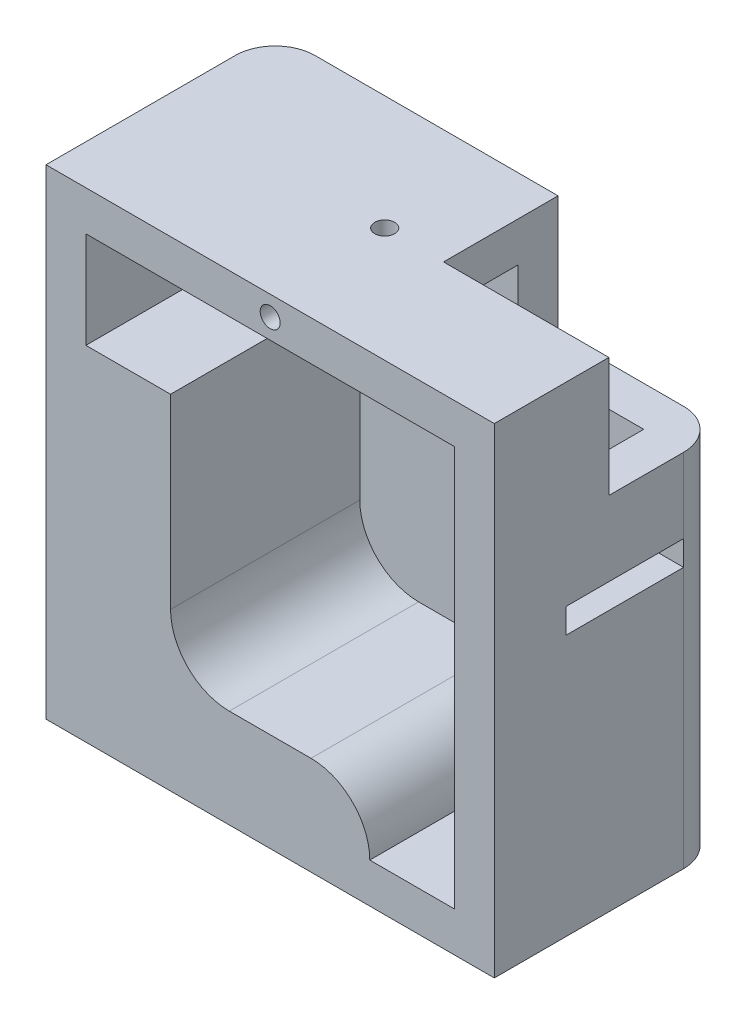
ISO-10303-21;
HEADER;
FILE_DESCRIPTION(('STEP AP214'),'2;1');
FILE_NAME('part.step','',(''),(''),'','','');
FILE_SCHEMA(('AUTOMOTIVE_DESIGN { 1 0 10303 214 1 1 1 1 }'));
ENDSEC;
DATA;
#1=APPLICATION_CONTEXT('core data for automotive mechanical design processes');
#2=APPLICATION_PROTOCOL_DEFINITION('international standard','automotive_design',2000,#1);
#3=PRODUCT_CONTEXT('',#1,'mechanical');
#4=PRODUCT('Part','Part','',(#3));
#5=PRODUCT_RELATED_PRODUCT_CATEGORY('part','',(#4));
#6=PRODUCT_DEFINITION_FORMATION('','',#4);
#7=PRODUCT_DEFINITION_CONTEXT('part definition',#1,'design');
#8=PRODUCT_DEFINITION('design','',#6,#7);
#9=PRODUCT_DEFINITION_SHAPE('','',#8);
#10=(LENGTH_UNIT() NAMED_UNIT(*) SI_UNIT(.MILLI.,.METRE.));
#11=(NAMED_UNIT(*) PLANE_ANGLE_UNIT() SI_UNIT($,.RADIAN.));
#12=(NAMED_UNIT(*) SI_UNIT($,.STERADIAN.) SOLID_ANGLE_UNIT());
#13=UNCERTAINTY_MEASURE_WITH_UNIT(LENGTH_MEASURE(1.E-05),#10,'distance_accuracy_value','');
#14=(GEOMETRIC_REPRESENTATION_CONTEXT(3) GLOBAL_UNCERTAINTY_ASSIGNED_CONTEXT((#13)) GLOBAL_UNIT_ASSIGNED_CONTEXT((#10,
#11,#12)) REPRESENTATION_CONTEXT('',''));
#15=CARTESIAN_POINT('',(0.,0.,0.));
#16=DIRECTION('',(0.,0.,1.));
#17=DIRECTION('',(1.,0.,0.));
#18=AXIS2_PLACEMENT_3D('',#15,#16,#17);
#19=CARTESIAN_POINT('',(22.5,24.1,-7.5));
#20=DIRECTION('',(0.,0.,1.));
#21=DIRECTION('',(1.,0.,0.));
#22=AXIS2_PLACEMENT_3D('',#19,#20,#21);
#23=PLANE('',#22);
#24=DIRECTION('',(0.,1.,0.));
#25=VECTOR('',#24,1.);
#26=CARTESIAN_POINT('',(-18.5,-20.1,-7.5));
#27=LINE('',#26,#25);
#28=CARTESIAN_POINT('',(-18.5,2.1,-7.5));
#29=VERTEX_POINT('',#28);
#30=CARTESIAN_POINT('',(-18.5,4.6,-7.5));
#31=VERTEX_POINT('',#30);
#32=EDGE_CURVE('E287',#29,#31,#27,.T.);
#33=ORIENTED_EDGE('',*,*,#32,.T.);
#34=DIRECTION('',(1.,0.,0.));
#35=VECTOR('',#34,1.);
#36=CARTESIAN_POINT('',(-22.5,4.6,-7.5));
#37=LINE('',#36,#35);
#38=CARTESIAN_POINT('',(-22.5,4.6,-7.5));
#39=VERTEX_POINT('',#38);
#40=EDGE_CURVE('E512',#39,#31,#37,.T.);
#41=ORIENTED_EDGE('',*,*,#40,.F.);
#42=DIRECTION('',(0.,1.,0.));
#43=VECTOR('',#42,1.);
#44=CARTESIAN_POINT('',(-22.5,4.6,-7.5));
#45=LINE('',#44,#43);
#46=CARTESIAN_POINT('',(-22.5,2.1,-7.5));
#47=VERTEX_POINT('',#46);
#48=EDGE_CURVE('E499',#47,#39,#45,.T.);
#49=ORIENTED_EDGE('',*,*,#48,.F.);
#50=DIRECTION('',(1.,0.,0.));
#51=VECTOR('',#50,1.);
#52=CARTESIAN_POINT('',(-22.5,2.1,-7.5));
#53=LINE('',#52,#51);
#54=EDGE_CURVE('E517',#47,#29,#53,.T.);
#55=ORIENTED_EDGE('',*,*,#54,.T.);
#56=EDGE_LOOP('',(#33,#41,#49,#55));
#57=FACE_BOUND('',#56,.T.);
#58=ADVANCED_FACE('F47',(#57),#23,.T.);
#59=CARTESIAN_POINT('',(22.5,24.1,-11.5));
#60=DIRECTION('',(0.,0.,1.));
#61=DIRECTION('',(1.,0.,0.));
#62=AXIS2_PLACEMENT_3D('',#59,#60,#61);
#63=PLANE('',#62);
#64=DIRECTION('',(-1.,0.,0.));
#65=VECTOR('',#64,1.);
#66=CARTESIAN_POINT('',(22.5,24.1,-11.5));
#67=LINE('',#66,#65);
#68=CARTESIAN_POINT('',(5.9,24.1,-11.5));
#69=VERTEX_POINT('',#68);
#70=CARTESIAN_POINT('',(-18.5,24.1,-11.5));
#71=VERTEX_POINT('',#70);
#72=EDGE_CURVE('E381',#69,#71,#67,.T.);
#73=ORIENTED_EDGE('',*,*,#72,.F.);
#74=DIRECTION('',(0.,-1.,0.));
#75=VECTOR('',#74,1.);
#76=CARTESIAN_POINT('',(5.9,18.4,-11.5));
#77=LINE('',#76,#75);
#78=CARTESIAN_POINT('',(5.9,12.1,-11.5));
#79=VERTEX_POINT('',#78);
#80=EDGE_CURVE('E541',#69,#79,#77,.T.);
#81=ORIENTED_EDGE('',*,*,#80,.T.);
#82=DIRECTION('',(-1.,0.,0.));
#83=VECTOR('',#82,1.);
#84=CARTESIAN_POINT('',(18.5,12.1,-11.5));
#85=LINE('',#84,#83);
#86=CARTESIAN_POINT('',(18.5,12.1,-11.5));
#87=VERTEX_POINT('',#86);
#88=EDGE_CURVE('E618',#87,#79,#85,.T.);
#89=ORIENTED_EDGE('',*,*,#88,.F.);
#90=DIRECTION('',(0.,1.,0.));
#91=VECTOR('',#90,1.);
#92=CARTESIAN_POINT('',(18.5,24.1,-11.5));
#93=LINE('',#92,#91);
#94=CARTESIAN_POINT('',(18.5,-24.1,-11.5));
#95=VERTEX_POINT('',#94);
#96=EDGE_CURVE('E400',#87,#95,#93,.F.);
#97=ORIENTED_EDGE('',*,*,#96,.T.);
#98=DIRECTION('',(-1.,0.,0.));
#99=VECTOR('',#98,1.);
#100=CARTESIAN_POINT('',(22.5,-24.1,-11.5));
#101=LINE('',#100,#99);
#102=CARTESIAN_POINT('',(-18.5,-24.1,-11.5));
#103=VERTEX_POINT('',#102);
#104=EDGE_CURVE('E361',#95,#103,#101,.T.);
#105=ORIENTED_EDGE('',*,*,#104,.T.);
#106=DIRECTION('',(0.,1.,0.));
#107=VECTOR('',#106,1.);
#108=CARTESIAN_POINT('',(-18.5,14.9,-11.5));
#109=LINE('',#108,#107);
#110=CARTESIAN_POINT('',(-18.5,14.9,-11.5));
#111=VERTEX_POINT('',#110);
#112=EDGE_CURVE('E396',#103,#111,#109,.T.);
#113=ORIENTED_EDGE('',*,*,#112,.T.);
#114=DIRECTION('',(-1.,0.,0.));
#115=VECTOR('',#114,1.);
#116=CARTESIAN_POINT('',(-22.5,14.9,-11.5));
#117=LINE('',#116,#115);
#118=CARTESIAN_POINT('',(-5.9,14.9,-11.5));
#119=VERTEX_POINT('',#118);
#120=EDGE_CURVE('E545',#119,#111,#117,.T.);
#121=ORIENTED_EDGE('',*,*,#120,.F.);
#122=DIRECTION('',(0.,-1.,0.));
#123=VECTOR('',#122,1.);
#124=CARTESIAN_POINT('',(-5.9,18.4,-11.5));
#125=LINE('',#124,#123);
#126=CARTESIAN_POINT('',(-5.9,18.4,-11.5));
#127=VERTEX_POINT('',#126);
#128=EDGE_CURVE('E439',#127,#119,#125,.T.);
#129=ORIENTED_EDGE('',*,*,#128,.F.);
#130=DIRECTION('',(-1.,0.,0.));
#131=VECTOR('',#130,1.);
#132=CARTESIAN_POINT('',(-22.5,18.4,-11.5));
#133=LINE('',#132,#131);
#134=CARTESIAN_POINT('',(-18.5,18.4,-11.5));
#135=VERTEX_POINT('',#134);
#136=EDGE_CURVE('E427',#127,#135,#133,.T.);
#137=ORIENTED_EDGE('',*,*,#136,.T.);
#138=DIRECTION('',(0.,1.,0.));
#139=VECTOR('',#138,1.);
#140=CARTESIAN_POINT('',(-18.5,24.1,-11.5));
#141=LINE('',#140,#139);
#142=EDGE_CURVE('E392',#135,#71,#141,.T.);
#143=ORIENTED_EDGE('',*,*,#142,.T.);
#144=EDGE_LOOP('',(#73,#81,#89,#97,#105,#113,#121,#129,#137,#143));
#145=FACE_BOUND('',#144,.T.);
#146=ADVANCED_FACE('F436',(#145),#63,.F.);
#147=DIRECTION('',(1.,0.,0.));
#148=VECTOR('',#147,1.);
#149=CARTESIAN_POINT('',(-18.5,10.4,-7.5));
#150=LINE('',#149,#148);
#151=CARTESIAN_POINT('',(-18.5,10.4,-7.5));
#152=VERTEX_POINT('',#151);
#153=CARTESIAN_POINT('',(-10.,10.4,-7.5));
#154=VERTEX_POINT('',#153);
#155=EDGE_CURVE('E275',#152,#154,#150,.T.);
#156=ORIENTED_EDGE('',*,*,#155,.T.);
#157=DIRECTION('',(0.,-1.,0.));
#158=VECTOR('',#157,1.);
#159=CARTESIAN_POINT('',(-10.,10.4,-7.5));
#160=LINE('',#159,#158);
#161=CARTESIAN_POINT('',(-10.,-8.3,-7.5));
#162=VERTEX_POINT('',#161);
#163=EDGE_CURVE('E286',#154,#162,#160,.T.);
#164=ORIENTED_EDGE('',*,*,#163,.T.);
#165=CARTESIAN_POINT('',(-4.1,-8.3,-7.5));
#166=DIRECTION('',(0.,0.,1.));
#167=DIRECTION('',(1.,0.,0.));
#168=AXIS2_PLACEMENT_3D('',#165,#166,#167);
#169=CIRCLE('',#168,5.9);
#170=CARTESIAN_POINT('',(-4.1,-14.2,-7.5));
#171=VERTEX_POINT('',#170);
#172=EDGE_CURVE('E777',#162,#171,#169,.T.);
#173=ORIENTED_EDGE('',*,*,#172,.T.);
#174=DIRECTION('',(1.,0.,0.));
#175=VECTOR('',#174,1.);
#176=CARTESIAN_POINT('',(4.1,-14.2,-7.5));
#177=LINE('',#176,#175);
#178=CARTESIAN_POINT('',(4.1,-14.2,-7.5));
#179=VERTEX_POINT('',#178);
#180=EDGE_CURVE('E670',#171,#179,#177,.T.);
#181=ORIENTED_EDGE('',*,*,#180,.T.);
#182=CARTESIAN_POINT('',(4.1,-20.1,-7.5));
#183=DIRECTION('',(0.,0.,1.));
#184=DIRECTION('',(1.,0.,0.));
#185=AXIS2_PLACEMENT_3D('',#182,#183,#184);
#186=CIRCLE('',#185,5.9);
#187=CARTESIAN_POINT('',(10.,-20.1,-7.5));
#188=VERTEX_POINT('',#187);
#189=EDGE_CURVE('E669',#179,#188,#186,.F.);
#190=ORIENTED_EDGE('',*,*,#189,.T.);
#191=DIRECTION('',(-1.,0.,0.));
#192=VECTOR('',#191,1.);
#193=CARTESIAN_POINT('',(22.5,-20.1,-7.5));
#194=LINE('',#193,#192);
#195=CARTESIAN_POINT('',(18.5,-20.1,-7.5));
#196=VERTEX_POINT('',#195);
#197=EDGE_CURVE('E328',#196,#188,#194,.T.);
#198=ORIENTED_EDGE('',*,*,#197,.F.);
#199=DIRECTION('',(0.,1.,0.));
#200=VECTOR('',#199,1.);
#201=CARTESIAN_POINT('',(18.5,0.,-7.5));
#202=LINE('',#201,#200);
#203=CARTESIAN_POINT('',(18.5,2.1,-7.5));
#204=VERTEX_POINT('',#203);
#205=EDGE_CURVE('E322',#196,#204,#202,.T.);
#206=ORIENTED_EDGE('',*,*,#205,.T.);
#207=CARTESIAN_POINT('',(22.5,2.1,-7.5));
#208=VERTEX_POINT('',#207);
#209=EDGE_CURVE('E521',#204,#208,#53,.T.);
#210=ORIENTED_EDGE('',*,*,#209,.T.);
#211=DIRECTION('',(0.,1.,0.));
#212=VECTOR('',#211,1.);
#213=CARTESIAN_POINT('',(22.5,4.6,-7.5));
#214=LINE('',#213,#212);
#215=CARTESIAN_POINT('',(22.5,4.6,-7.5));
#216=VERTEX_POINT('',#215);
#217=EDGE_CURVE('E474',#208,#216,#214,.T.);
#218=ORIENTED_EDGE('',*,*,#217,.T.);
#219=CARTESIAN_POINT('',(18.5,4.6,-7.5));
#220=VERTEX_POINT('',#219);
#221=EDGE_CURVE('E516',#220,#216,#37,.T.);
#222=ORIENTED_EDGE('',*,*,#221,.F.);
#223=CARTESIAN_POINT('',(18.5,12.1,-7.5));
#224=VERTEX_POINT('',#223);
#225=EDGE_CURVE('E327',#220,#224,#202,.T.);
#226=ORIENTED_EDGE('',*,*,#225,.T.);
#227=DIRECTION('',(-1.,0.,0.));
#228=VECTOR('',#227,1.);
#229=CARTESIAN_POINT('',(22.5,12.1,-7.5));
#230=LINE('',#229,#228);
#231=CARTESIAN_POINT('',(5.9,12.1,-7.5));
#232=VERTEX_POINT('',#231);
#233=EDGE_CURVE('E638',#224,#232,#230,.T.);
#234=ORIENTED_EDGE('',*,*,#233,.T.);
#235=DIRECTION('',(0.,-1.,0.));
#236=VECTOR('',#235,1.);
#237=CARTESIAN_POINT('',(5.9,18.4,-7.49999999999999));
#238=LINE('',#237,#236);
#239=CARTESIAN_POINT('',(5.9,20.1,-7.5));
#240=VERTEX_POINT('',#239);
#241=EDGE_CURVE('E589',#240,#232,#238,.T.);
#242=ORIENTED_EDGE('',*,*,#241,.F.);
#243=DIRECTION('',(-1.,0.,0.));
#244=VECTOR('',#243,1.);
#245=CARTESIAN_POINT('',(22.5,20.1,-7.5));
#246=LINE('',#245,#244);
#247=CARTESIAN_POINT('',(-18.5,20.1,-7.5));
#248=VERTEX_POINT('',#247);
#249=EDGE_CURVE('E317',#240,#248,#246,.T.);
#250=ORIENTED_EDGE('',*,*,#249,.T.);
#251=DIRECTION('',(0.,1.,0.));
#252=VECTOR('',#251,1.);
#253=CARTESIAN_POINT('',(-18.5,0.,-7.5));
#254=LINE('',#253,#252);
#255=CARTESIAN_POINT('',(-18.5,18.4,-7.50000000000001));
#256=VERTEX_POINT('',#255);
#257=EDGE_CURVE('E306',#256,#248,#254,.T.);
#258=ORIENTED_EDGE('',*,*,#257,.F.);
#259=DIRECTION('',(1.,0.,0.));
#260=VECTOR('',#259,1.);
#261=CARTESIAN_POINT('',(-5.9,18.4,-7.50000000000001));
#262=LINE('',#261,#260);
#263=CARTESIAN_POINT('',(-5.9,18.4,-7.50000000000001));
#264=VERTEX_POINT('',#263);
#265=EDGE_CURVE('E552',#256,#264,#262,.T.);
#266=ORIENTED_EDGE('',*,*,#265,.T.);
#267=DIRECTION('',(0.,-1.,0.));
#268=VECTOR('',#267,1.);
#269=CARTESIAN_POINT('',(-5.9,18.4,-7.50000000000001));
#270=LINE('',#269,#268);
#271=CARTESIAN_POINT('',(-5.9,14.9,-7.50000000000001));
#272=VERTEX_POINT('',#271);
#273=EDGE_CURVE('E578',#264,#272,#270,.T.);
#274=ORIENTED_EDGE('',*,*,#273,.T.);
#275=DIRECTION('',(1.,0.,0.));
#276=VECTOR('',#275,1.);
#277=CARTESIAN_POINT('',(-5.9,14.9,-7.50000000000001));
#278=LINE('',#277,#276);
#279=CARTESIAN_POINT('',(-18.5,14.9,-7.50000000000001));
#280=VERTEX_POINT('',#279);
#281=EDGE_CURVE('E303',#280,#272,#278,.T.);
#282=ORIENTED_EDGE('',*,*,#281,.F.);
#283=EDGE_CURVE('E293',#152,#280,#254,.T.);
#284=ORIENTED_EDGE('',*,*,#283,.F.);
#285=EDGE_LOOP('',(#156,#164,#173,#181,#190,#198,#206,#210,#218,#222,#226,#234,#242,#250,#258,
#266,#274,#282,#284));
#286=FACE_BOUND('',#285,.T.);
#287=ADVANCED_FACE('F301',(#286),#23,.T.);
#288=CARTESIAN_POINT('',(22.5,24.1,-11.5));
#289=DIRECTION('',(0.,-1.,0.));
#290=DIRECTION('',(0.,0.,-1.));
#291=AXIS2_PLACEMENT_3D('',#288,#289,#290);
#292=PLANE('',#291);
#293=CARTESIAN_POINT('',(0.,24.1,0.));
#294=DIRECTION('',(0.,-1.,0.));
#295=DIRECTION('',(0.,0.,-1.));
#296=AXIS2_PLACEMENT_3D('',#293,#294,#295);
#297=CIRCLE('',#296,1.);
#298=CARTESIAN_POINT('',(0.,24.1,-1.));
#299=VERTEX_POINT('',#298);
#300=EDGE_CURVE('E689',#299,#299,#297,.F.);
#301=ORIENTED_EDGE('',*,*,#300,.F.);
#302=EDGE_LOOP('',(#301));
#303=FACE_BOUND('',#302,.T.);
#304=DIRECTION('',(0.,0.,1.));
#305=VECTOR('',#304,1.);
#306=CARTESIAN_POINT('',(5.9,24.1,-11.5));
#307=LINE('',#306,#305);
#308=CARTESIAN_POINT('',(5.9,24.1,0.));
#309=VERTEX_POINT('',#308);
#310=EDGE_CURVE('E623',#69,#309,#307,.T.);
#311=ORIENTED_EDGE('',*,*,#310,.F.);
#312=ORIENTED_EDGE('',*,*,#72,.T.);
#313=CARTESIAN_POINT('',(-18.5,24.1,-7.5));
#314=DIRECTION('',(0.,-1.,0.));
#315=DIRECTION('',(0.,0.,-1.));
#316=AXIS2_PLACEMENT_3D('',#313,#314,#315);
#317=CIRCLE('',#316,4.);
#318=CARTESIAN_POINT('',(-22.5,24.1,-7.5));
#319=VERTEX_POINT('',#318);
#320=EDGE_CURVE('E389',#71,#319,#317,.F.);
#321=ORIENTED_EDGE('',*,*,#320,.T.);
#322=DIRECTION('',(0.,0.,1.));
#323=VECTOR('',#322,1.);
#324=CARTESIAN_POINT('',(-22.5,24.1,-11.5));
#325=LINE('',#324,#323);
#326=CARTESIAN_POINT('',(-22.5,24.1,11.5));
#327=VERTEX_POINT('',#326);
#328=EDGE_CURVE('E320',#319,#327,#325,.T.);
#329=ORIENTED_EDGE('',*,*,#328,.T.);
#330=DIRECTION('',(-1.,0.,0.));
#331=VECTOR('',#330,1.);
#332=CARTESIAN_POINT('',(22.5,24.1,11.5));
#333=LINE('',#332,#331);
#334=CARTESIAN_POINT('',(22.5,24.1,11.5));
#335=VERTEX_POINT('',#334);
#336=EDGE_CURVE('E377',#335,#327,#333,.T.);
#337=ORIENTED_EDGE('',*,*,#336,.F.);
#338=DIRECTION('',(0.,0.,1.));
#339=VECTOR('',#338,1.);
#340=CARTESIAN_POINT('',(22.5,24.1,-11.5));
#341=LINE('',#340,#339);
#342=CARTESIAN_POINT('',(22.5,24.1,0.));
#343=VERTEX_POINT('',#342);
#344=EDGE_CURVE('E350',#343,#335,#341,.T.);
#345=ORIENTED_EDGE('',*,*,#344,.F.);
#346=DIRECTION('',(1.,0.,0.));
#347=VECTOR('',#346,1.);
#348=CARTESIAN_POINT('',(18.5,24.1,0.));
#349=LINE('',#348,#347);
#350=EDGE_CURVE('E605',#309,#343,#349,.T.);
#351=ORIENTED_EDGE('',*,*,#350,.F.);
#352=EDGE_LOOP('',(#311,#312,#321,#329,#337,#345,#351));
#353=FACE_BOUND('',#352,.T.);
#354=ADVANCED_FACE('F447',(#303,#353),#292,.F.);
#355=CARTESIAN_POINT('',(22.5,0.,0.));
#356=DIRECTION('',(-1.,0.,0.));
#357=DIRECTION('',(0.,0.,1.));
#358=AXIS2_PLACEMENT_3D('',#355,#356,#357);
#359=PLANE('',#358);
#360=DIRECTION('',(0.,-1.,0.));
#361=VECTOR('',#360,1.);
#362=CARTESIAN_POINT('',(22.5,18.4,0.));
#363=LINE('',#362,#361);
#364=CARTESIAN_POINT('',(22.5,12.1,0.));
#365=VERTEX_POINT('',#364);
#366=EDGE_CURVE('E315',#343,#365,#363,.T.);
#367=ORIENTED_EDGE('',*,*,#366,.F.);
#368=ORIENTED_EDGE('',*,*,#344,.T.);
#369=DIRECTION('',(0.,-1.,0.));
#370=VECTOR('',#369,1.);
#371=CARTESIAN_POINT('',(22.5,24.1,11.5));
#372=LINE('',#371,#370);
#373=CARTESIAN_POINT('',(22.5,-24.1,11.5));
#374=VERTEX_POINT('',#373);
#375=EDGE_CURVE('E353',#335,#374,#372,.T.);
#376=ORIENTED_EDGE('',*,*,#375,.T.);
#377=DIRECTION('',(0.,0.,-1.));
#378=VECTOR('',#377,1.);
#379=CARTESIAN_POINT('',(22.5,-24.1,-11.5));
#380=LINE('',#379,#378);
#381=CARTESIAN_POINT('',(22.5,-24.1,-7.5));
#382=VERTEX_POINT('',#381);
#383=EDGE_CURVE('E357',#374,#382,#380,.T.);
#384=ORIENTED_EDGE('',*,*,#383,.T.);
#385=DIRECTION('',(0.,1.,0.));
#386=VECTOR('',#385,1.);
#387=CARTESIAN_POINT('',(22.5,0.,-7.5));
#388=LINE('',#387,#386);
#389=EDGE_CURVE('E385',#382,#208,#388,.T.);
#390=ORIENTED_EDGE('',*,*,#389,.T.);
#391=DIRECTION('',(0.,0.,-1.));
#392=VECTOR('',#391,1.);
#393=CARTESIAN_POINT('',(22.5,2.1,-7.5));
#394=LINE('',#393,#392);
#395=CARTESIAN_POINT('',(22.5,2.1,4.3));
#396=VERTEX_POINT('',#395);
#397=EDGE_CURVE('E481',#396,#208,#394,.T.);
#398=ORIENTED_EDGE('',*,*,#397,.F.);
#399=DIRECTION('',(0.,-1.,0.));
#400=VECTOR('',#399,1.);
#401=CARTESIAN_POINT('',(22.5,4.6,4.3));
#402=LINE('',#401,#400);
#403=CARTESIAN_POINT('',(22.5,4.6,4.3));
#404=VERTEX_POINT('',#403);
#405=EDGE_CURVE('E488',#404,#396,#402,.T.);
#406=ORIENTED_EDGE('',*,*,#405,.F.);
#407=DIRECTION('',(0.,0.,1.));
#408=VECTOR('',#407,1.);
#409=CARTESIAN_POINT('',(22.5,4.6,-7.5));
#410=LINE('',#409,#408);
#411=EDGE_CURVE('E480',#216,#404,#410,.T.);
#412=ORIENTED_EDGE('',*,*,#411,.F.);
#413=CARTESIAN_POINT('',(22.5,12.1,-7.5));
#414=VERTEX_POINT('',#413);
#415=EDGE_CURVE('E384',#216,#414,#388,.T.);
#416=ORIENTED_EDGE('',*,*,#415,.T.);
#417=DIRECTION('',(0.,0.,-1.));
#418=VECTOR('',#417,1.);
#419=CARTESIAN_POINT('',(22.5,12.1,0.));
#420=LINE('',#419,#418);
#421=EDGE_CURVE('E63',#365,#414,#420,.T.);
#422=ORIENTED_EDGE('',*,*,#421,.F.);
#423=EDGE_LOOP('',(#367,#368,#376,#384,#390,#398,#406,#412,#416,#422));
#424=FACE_BOUND('',#423,.T.);
#425=ADVANCED_FACE('F466',(#424),#359,.F.);
#426=CARTESIAN_POINT('',(22.5,20.1,-11.5));
#427=DIRECTION('',(0.,-1.,0.));
#428=DIRECTION('',(0.,0.,-1.));
#429=AXIS2_PLACEMENT_3D('',#426,#427,#428);
#430=PLANE('',#429);
#431=CARTESIAN_POINT('',(0.,20.1,0.));
#432=DIRECTION('',(0.,-1.,0.));
#433=DIRECTION('',(0.,0.,-1.));
#434=AXIS2_PLACEMENT_3D('',#431,#432,#433);
#435=CIRCLE('',#434,1.);
#436=CARTESIAN_POINT('',(0.,20.1,-1.));
#437=VERTEX_POINT('',#436);
#438=EDGE_CURVE('E682',#437,#437,#435,.F.);
#439=ORIENTED_EDGE('',*,*,#438,.T.);
#440=EDGE_LOOP('',(#439));
#441=FACE_BOUND('',#440,.T.);
#442=ORIENTED_EDGE('',*,*,#249,.F.);
#443=DIRECTION('',(0.,0.,1.));
#444=VECTOR('',#443,1.);
#445=CARTESIAN_POINT('',(5.9,20.1,-11.5));
#446=LINE('',#445,#444);
#447=CARTESIAN_POINT('',(5.9,20.1,0.));
#448=VERTEX_POINT('',#447);
#449=EDGE_CURVE('E646',#240,#448,#446,.T.);
#450=ORIENTED_EDGE('',*,*,#449,.T.);
#451=DIRECTION('',(1.,0.,0.));
#452=VECTOR('',#451,1.);
#453=CARTESIAN_POINT('',(22.5,20.1,0.));
#454=LINE('',#453,#452);
#455=CARTESIAN_POINT('',(18.5,20.1,0.));
#456=VERTEX_POINT('',#455);
#457=EDGE_CURVE('E642',#448,#456,#454,.T.);
#458=ORIENTED_EDGE('',*,*,#457,.T.);
#459=DIRECTION('',(0.,0.,1.));
#460=VECTOR('',#459,1.);
#461=CARTESIAN_POINT('',(18.5,20.1,0.));
#462=LINE('',#461,#460);
#463=CARTESIAN_POINT('',(18.5,20.1,11.5));
#464=VERTEX_POINT('',#463);
#465=EDGE_CURVE('E326',#456,#464,#462,.T.);
#466=ORIENTED_EDGE('',*,*,#465,.T.);
#467=DIRECTION('',(-1.,0.,0.));
#468=VECTOR('',#467,1.);
#469=CARTESIAN_POINT('',(22.5,20.1,11.5));
#470=LINE('',#469,#468);
#471=CARTESIAN_POINT('',(-18.5,20.1,11.5));
#472=VERTEX_POINT('',#471);
#473=EDGE_CURVE('E321',#464,#472,#470,.T.);
#474=ORIENTED_EDGE('',*,*,#473,.T.);
#475=DIRECTION('',(0.,0.,1.));
#476=VECTOR('',#475,1.);
#477=CARTESIAN_POINT('',(-18.5,20.1,0.));
#478=LINE('',#477,#476);
#479=EDGE_CURVE('E305',#248,#472,#478,.T.);
#480=ORIENTED_EDGE('',*,*,#479,.F.);
#481=EDGE_LOOP('',(#442,#450,#458,#466,#474,#480));
#482=FACE_BOUND('',#481,.T.);
#483=ADVANCED_FACE('F733',(#441,#482),#430,.T.);
#484=CARTESIAN_POINT('',(18.5,0.,0.));
#485=DIRECTION('',(-1.,0.,0.));
#486=DIRECTION('',(0.,0.,1.));
#487=AXIS2_PLACEMENT_3D('',#484,#485,#486);
#488=PLANE('',#487);
#489=ORIENTED_EDGE('',*,*,#465,.F.);
#490=DIRECTION('',(0.,-1.,0.));
#491=VECTOR('',#490,1.);
#492=CARTESIAN_POINT('',(18.5,18.4,0.));
#493=LINE('',#492,#491);
#494=CARTESIAN_POINT('',(18.5,12.1,0.));
#495=VERTEX_POINT('',#494);
#496=EDGE_CURVE('E591',#456,#495,#493,.T.);
#497=ORIENTED_EDGE('',*,*,#496,.T.);
#498=DIRECTION('',(0.,0.,-1.));
#499=VECTOR('',#498,1.);
#500=CARTESIAN_POINT('',(18.5,12.1,0.));
#501=LINE('',#500,#499);
#502=EDGE_CURVE('E608',#495,#224,#501,.T.);
#503=ORIENTED_EDGE('',*,*,#502,.T.);
#504=ORIENTED_EDGE('',*,*,#225,.F.);
#505=DIRECTION('',(0.,0.,-1.));
#506=VECTOR('',#505,1.);
#507=CARTESIAN_POINT('',(18.5,4.6,0.));
#508=LINE('',#507,#506);
#509=CARTESIAN_POINT('',(18.5,4.6,4.3));
#510=VERTEX_POINT('',#509);
#511=EDGE_CURVE('E530',#510,#220,#508,.T.);
#512=ORIENTED_EDGE('',*,*,#511,.F.);
#513=DIRECTION('',(0.,1.,0.));
#514=VECTOR('',#513,1.);
#515=CARTESIAN_POINT('',(18.5,0.,4.3));
#516=LINE('',#515,#514);
#517=CARTESIAN_POINT('',(18.5,2.1,4.3));
#518=VERTEX_POINT('',#517);
#519=EDGE_CURVE('E11',#518,#510,#516,.T.);
#520=ORIENTED_EDGE('',*,*,#519,.F.);
#521=DIRECTION('',(0.,0.,1.));
#522=VECTOR('',#521,1.);
#523=CARTESIAN_POINT('',(18.5,2.1,0.));
#524=LINE('',#523,#522);
#525=EDGE_CURVE('E510',#204,#518,#524,.T.);
#526=ORIENTED_EDGE('',*,*,#525,.F.);
#527=ORIENTED_EDGE('',*,*,#205,.F.);
#528=DIRECTION('',(0.,0.,-1.));
#529=VECTOR('',#528,1.);
#530=CARTESIAN_POINT('',(18.5,-20.1,0.));
#531=LINE('',#530,#529);
#532=CARTESIAN_POINT('',(18.5,-20.1,11.5));
#533=VERTEX_POINT('',#532);
#534=EDGE_CURVE('E332',#533,#196,#531,.T.);
#535=ORIENTED_EDGE('',*,*,#534,.F.);
#536=DIRECTION('',(0.,-1.,0.));
#537=VECTOR('',#536,1.);
#538=CARTESIAN_POINT('',(18.5,0.,11.5));
#539=LINE('',#538,#537);
#540=EDGE_CURVE('E336',#464,#533,#539,.T.);
#541=ORIENTED_EDGE('',*,*,#540,.F.);
#542=EDGE_LOOP('',(#489,#497,#503,#504,#512,#520,#526,#527,#535,#541));
#543=FACE_BOUND('',#542,.T.);
#544=ADVANCED_FACE('F714',(#543),#488,.T.);
#545=CARTESIAN_POINT('',(18.5,0.,-7.5));
#546=DIRECTION('',(0.,1.,0.));
#547=DIRECTION('',(0.,0.,1.));
#548=AXIS2_PLACEMENT_3D('',#545,#546,#547);
#549=CYLINDRICAL_SURFACE('',#548,4.);
#550=ORIENTED_EDGE('',*,*,#96,.F.);
#551=CARTESIAN_POINT('',(18.5,12.1,-7.5));
#552=DIRECTION('',(0.,1.,0.));
#553=DIRECTION('',(0.,0.,1.));
#554=AXIS2_PLACEMENT_3D('',#551,#552,#553);
#555=CIRCLE('',#554,4.);
#556=EDGE_CURVE('E613',#414,#87,#555,.T.);
#557=ORIENTED_EDGE('',*,*,#556,.F.);
#558=ORIENTED_EDGE('',*,*,#415,.F.);
#559=ORIENTED_EDGE('',*,*,#217,.F.);
#560=ORIENTED_EDGE('',*,*,#389,.F.);
#561=CARTESIAN_POINT('',(18.5,-24.1,-7.5));
#562=DIRECTION('',(0.,1.,0.));
#563=DIRECTION('',(0.,0.,1.));
#564=AXIS2_PLACEMENT_3D('',#561,#562,#563);
#565=CIRCLE('',#564,4.);
#566=EDGE_CURVE('E406',#95,#382,#565,.F.);
#567=ORIENTED_EDGE('',*,*,#566,.F.);
#568=EDGE_LOOP('',(#550,#557,#558,#559,#560,#567));
#569=FACE_BOUND('',#568,.T.);
#570=ADVANCED_FACE('F471',(#569),#549,.T.);
#571=CARTESIAN_POINT('',(22.5,-20.1,-11.5));
#572=DIRECTION('',(0.,1.,0.));
#573=DIRECTION('',(0.,0.,1.));
#574=AXIS2_PLACEMENT_3D('',#571,#572,#573);
#575=PLANE('',#574);
#576=DIRECTION('',(0.,0.,1.));
#577=VECTOR('',#576,1.);
#578=CARTESIAN_POINT('',(10.,-20.1,-11.502));
#579=LINE('',#578,#577);
#580=CARTESIAN_POINT('',(10.,-20.1,11.5));
#581=VERTEX_POINT('',#580);
#582=EDGE_CURVE('E665',#188,#581,#579,.T.);
#583=ORIENTED_EDGE('',*,*,#582,.T.);
#584=DIRECTION('',(-1.,0.,0.));
#585=VECTOR('',#584,1.);
#586=CARTESIAN_POINT('',(22.5,-20.1,11.5));
#587=LINE('',#586,#585);
#588=EDGE_CURVE('E331',#533,#581,#587,.T.);
#589=ORIENTED_EDGE('',*,*,#588,.F.);
#590=ORIENTED_EDGE('',*,*,#534,.T.);
#591=ORIENTED_EDGE('',*,*,#197,.T.);
#592=EDGE_LOOP('',(#583,#589,#590,#591));
#593=FACE_BOUND('',#592,.T.);
#594=ADVANCED_FACE('F794',(#593),#575,.T.);
#595=CARTESIAN_POINT('',(-22.5,0.,0.));
#596=DIRECTION('',(-1.,0.,0.));
#597=DIRECTION('',(0.,0.,1.));
#598=AXIS2_PLACEMENT_3D('',#595,#596,#597);
#599=PLANE('',#598);
#600=DIRECTION('',(0.,0.,1.));
#601=VECTOR('',#600,1.);
#602=CARTESIAN_POINT('',(-22.5,4.6,-7.5));
#603=LINE('',#602,#601);
#604=CARTESIAN_POINT('',(-22.5,4.6,4.3));
#605=VERTEX_POINT('',#604);
#606=EDGE_CURVE('E503',#39,#605,#603,.T.);
#607=ORIENTED_EDGE('',*,*,#606,.T.);
#608=DIRECTION('',(0.,-1.,0.));
#609=VECTOR('',#608,1.);
#610=CARTESIAN_POINT('',(-22.5,4.6,4.3));
#611=LINE('',#610,#609);
#612=CARTESIAN_POINT('',(-22.5,2.1,4.3));
#613=VERTEX_POINT('',#612);
#614=EDGE_CURVE('E486',#605,#613,#611,.T.);
#615=ORIENTED_EDGE('',*,*,#614,.T.);
#616=DIRECTION('',(0.,0.,-1.));
#617=VECTOR('',#616,1.);
#618=CARTESIAN_POINT('',(-22.5,2.1,-7.5));
#619=LINE('',#618,#617);
#620=EDGE_CURVE('E495',#613,#47,#619,.T.);
#621=ORIENTED_EDGE('',*,*,#620,.T.);
#622=DIRECTION('',(0.,1.,0.));
#623=VECTOR('',#622,1.);
#624=CARTESIAN_POINT('',(-22.5,-24.1,-7.5));
#625=LINE('',#624,#623);
#626=CARTESIAN_POINT('',(-22.5,-24.1,-7.5));
#627=VERTEX_POINT('',#626);
#628=EDGE_CURVE('E415',#47,#627,#625,.F.);
#629=ORIENTED_EDGE('',*,*,#628,.T.);
#630=DIRECTION('',(0.,0.,-1.));
#631=VECTOR('',#630,1.);
#632=CARTESIAN_POINT('',(-22.5,-24.1,-11.5));
#633=LINE('',#632,#631);
#634=CARTESIAN_POINT('',(-22.5,-24.1,11.5));
#635=VERTEX_POINT('',#634);
#636=EDGE_CURVE('E354',#635,#627,#633,.T.);
#637=ORIENTED_EDGE('',*,*,#636,.F.);
#638=DIRECTION('',(0.,-1.,0.));
#639=VECTOR('',#638,1.);
#640=CARTESIAN_POINT('',(-22.5,24.1,11.5));
#641=LINE('',#640,#639);
#642=EDGE_CURVE('E364',#327,#635,#641,.T.);
#643=ORIENTED_EDGE('',*,*,#642,.F.);
#644=ORIENTED_EDGE('',*,*,#328,.F.);
#645=DIRECTION('',(0.,1.,0.));
#646=VECTOR('',#645,1.);
#647=CARTESIAN_POINT('',(-22.5,18.4,-7.5));
#648=LINE('',#647,#646);
#649=CARTESIAN_POINT('',(-22.5,18.4,-7.5));
#650=VERTEX_POINT('',#649);
#651=EDGE_CURVE('E412',#319,#650,#648,.F.);
#652=ORIENTED_EDGE('',*,*,#651,.T.);
#653=DIRECTION('',(0.,0.,1.));
#654=VECTOR('',#653,1.);
#655=CARTESIAN_POINT('',(-22.5,18.4,0.));
#656=LINE('',#655,#654);
#657=CARTESIAN_POINT('',(-22.5,18.4,0.));
#658=VERTEX_POINT('',#657);
#659=EDGE_CURVE('E430',#650,#658,#656,.T.);
#660=ORIENTED_EDGE('',*,*,#659,.T.);
#661=DIRECTION('',(0.,-1.,0.));
#662=VECTOR('',#661,1.);
#663=CARTESIAN_POINT('',(-22.5,18.4,0.));
#664=LINE('',#663,#662);
#665=CARTESIAN_POINT('',(-22.5,14.9,0.));
#666=VERTEX_POINT('',#665);
#667=EDGE_CURVE('E312',#658,#666,#664,.T.);
#668=ORIENTED_EDGE('',*,*,#667,.T.);
#669=DIRECTION('',(0.,0.,1.));
#670=VECTOR('',#669,1.);
#671=CARTESIAN_POINT('',(-22.5,14.9,0.));
#672=LINE('',#671,#670);
#673=CARTESIAN_POINT('',(-22.5,14.9,-7.5));
#674=VERTEX_POINT('',#673);
#675=EDGE_CURVE('E558',#674,#666,#672,.T.);
#676=ORIENTED_EDGE('',*,*,#675,.F.);
#677=EDGE_CURVE('E416',#674,#39,#625,.F.);
#678=ORIENTED_EDGE('',*,*,#677,.T.);
#679=EDGE_LOOP('',(#607,#615,#621,#629,#637,#643,#644,#652,#660,#668,#676,#678));
#680=FACE_BOUND('',#679,.T.);
#681=ADVANCED_FACE('F452',(#680),#599,.T.);
#682=CARTESIAN_POINT('',(-18.5,0.,0.));
#683=DIRECTION('',(-1.,0.,0.));
#684=DIRECTION('',(0.,0.,1.));
#685=AXIS2_PLACEMENT_3D('',#682,#683,#684);
#686=PLANE('',#685);
#687=DIRECTION('',(0.,-1.,0.));
#688=VECTOR('',#687,1.);
#689=CARTESIAN_POINT('',(-18.5,0.,11.5));
#690=LINE('',#689,#688);
#691=CARTESIAN_POINT('',(-18.5,10.4,11.5));
#692=VERTEX_POINT('',#691);
#693=EDGE_CURVE('E296',#472,#692,#690,.T.);
#694=ORIENTED_EDGE('',*,*,#693,.T.);
#695=DIRECTION('',(0.,0.,1.));
#696=VECTOR('',#695,1.);
#697=CARTESIAN_POINT('',(-18.5,10.4,-11.502));
#698=LINE('',#697,#696);
#699=EDGE_CURVE('E279',#152,#692,#698,.T.);
#700=ORIENTED_EDGE('',*,*,#699,.F.);
#701=ORIENTED_EDGE('',*,*,#283,.T.);
#702=DIRECTION('',(0.,0.,-1.));
#703=VECTOR('',#702,1.);
#704=CARTESIAN_POINT('',(-18.5,14.9,-7.50000000000001));
#705=LINE('',#704,#703);
#706=CARTESIAN_POINT('',(-18.5,14.9,0.));
#707=VERTEX_POINT('',#706);
#708=EDGE_CURVE('E565',#707,#280,#705,.T.);
#709=ORIENTED_EDGE('',*,*,#708,.F.);
#710=DIRECTION('',(0.,-1.,0.));
#711=VECTOR('',#710,1.);
#712=CARTESIAN_POINT('',(-18.5,18.4,0.));
#713=LINE('',#712,#711);
#714=CARTESIAN_POINT('',(-18.5,18.4,0.));
#715=VERTEX_POINT('',#714);
#716=EDGE_CURVE('E581',#715,#707,#713,.T.);
#717=ORIENTED_EDGE('',*,*,#716,.F.);
#718=DIRECTION('',(0.,0.,-1.));
#719=VECTOR('',#718,1.);
#720=CARTESIAN_POINT('',(-18.5,18.4,-7.50000000000001));
#721=LINE('',#720,#719);
#722=EDGE_CURVE('E548',#715,#256,#721,.T.);
#723=ORIENTED_EDGE('',*,*,#722,.T.);
#724=ORIENTED_EDGE('',*,*,#257,.T.);
#725=ORIENTED_EDGE('',*,*,#479,.T.);
#726=EDGE_LOOP('',(#694,#700,#701,#709,#717,#723,#724,#725));
#727=FACE_BOUND('',#726,.T.);
#728=ADVANCED_FACE('F291',(#727),#686,.F.);
#729=CARTESIAN_POINT('',(22.5,24.1,11.5));
#730=DIRECTION('',(0.,0.,-1.));
#731=DIRECTION('',(-1.,0.,0.));
#732=AXIS2_PLACEMENT_3D('',#729,#730,#731);
#733=PLANE('',#732);
#734=DIRECTION('',(-1.,0.,0.));
#735=VECTOR('',#734,1.);
#736=CARTESIAN_POINT('',(-18.5,10.4,11.5));
#737=LINE('',#736,#735);
#738=CARTESIAN_POINT('',(-10.,10.4,11.5));
#739=VERTEX_POINT('',#738);
#740=EDGE_CURVE('E614',#739,#692,#737,.T.);
#741=ORIENTED_EDGE('',*,*,#740,.T.);
#742=ORIENTED_EDGE('',*,*,#693,.F.);
#743=ORIENTED_EDGE('',*,*,#473,.F.);
#744=ORIENTED_EDGE('',*,*,#540,.T.);
#745=ORIENTED_EDGE('',*,*,#588,.T.);
#746=CARTESIAN_POINT('',(4.1,-20.1,11.5));
#747=DIRECTION('',(0.,0.,1.));
#748=DIRECTION('',(1.,0.,0.));
#749=AXIS2_PLACEMENT_3D('',#746,#747,#748);
#750=CIRCLE('',#749,5.9);
#751=CARTESIAN_POINT('',(4.1,-14.2,11.5));
#752=VERTEX_POINT('',#751);
#753=EDGE_CURVE('E650',#581,#752,#750,.T.);
#754=ORIENTED_EDGE('',*,*,#753,.T.);
#755=DIRECTION('',(-1.,0.,0.));
#756=VECTOR('',#755,1.);
#757=CARTESIAN_POINT('',(4.1,-14.2,11.5));
#758=LINE('',#757,#756);
#759=CARTESIAN_POINT('',(-4.1,-14.2,11.5));
#760=VERTEX_POINT('',#759);
#761=EDGE_CURVE('E654',#752,#760,#758,.T.);
#762=ORIENTED_EDGE('',*,*,#761,.T.);
#763=CARTESIAN_POINT('',(-4.1,-8.3,11.5));
#764=DIRECTION('',(0.,0.,-1.));
#765=DIRECTION('',(-1.,0.,0.));
#766=AXIS2_PLACEMENT_3D('',#763,#764,#765);
#767=CIRCLE('',#766,5.9);
#768=CARTESIAN_POINT('',(-10.,-8.3,11.5));
#769=VERTEX_POINT('',#768);
#770=EDGE_CURVE('E298',#760,#769,#767,.T.);
#771=ORIENTED_EDGE('',*,*,#770,.T.);
#772=DIRECTION('',(0.,1.,0.));
#773=VECTOR('',#772,1.);
#774=CARTESIAN_POINT('',(-10.,10.4,11.5));
#775=LINE('',#774,#773);
#776=EDGE_CURVE('E620',#769,#739,#775,.T.);
#777=ORIENTED_EDGE('',*,*,#776,.T.);
#778=EDGE_LOOP('',(#741,#742,#743,#744,#745,#754,#762,#771,#777));
#779=FACE_BOUND('',#778,.T.);
#780=CARTESIAN_POINT('',(0.,22.1,11.5));
#781=DIRECTION('',(0.,0.,1.));
#782=DIRECTION('',(1.,0.,0.));
#783=AXIS2_PLACEMENT_3D('',#780,#781,#782);
#784=CIRCLE('',#783,1.);
#785=CARTESIAN_POINT('',(1.,22.1,11.5));
#786=VERTEX_POINT('',#785);
#787=EDGE_CURVE('E674',#786,#786,#784,.T.);
#788=ORIENTED_EDGE('',*,*,#787,.F.);
#789=EDGE_LOOP('',(#788));
#790=FACE_BOUND('',#789,.T.);
#791=ORIENTED_EDGE('',*,*,#642,.T.);
#792=DIRECTION('',(-1.,0.,0.));
#793=VECTOR('',#792,1.);
#794=CARTESIAN_POINT('',(22.5,-24.1,11.5));
#795=LINE('',#794,#793);
#796=EDGE_CURVE('E373',#374,#635,#795,.T.);
#797=ORIENTED_EDGE('',*,*,#796,.F.);
#798=ORIENTED_EDGE('',*,*,#375,.F.);
#799=ORIENTED_EDGE('',*,*,#336,.T.);
#800=EDGE_LOOP('',(#791,#797,#798,#799));
#801=FACE_BOUND('',#800,.T.);
#802=ADVANCED_FACE('F456',(#779,#790,#801),#733,.F.);
#803=CARTESIAN_POINT('',(22.5,-24.1,-11.5));
#804=DIRECTION('',(0.,1.,0.));
#805=DIRECTION('',(0.,0.,1.));
#806=AXIS2_PLACEMENT_3D('',#803,#804,#805);
#807=PLANE('',#806);
#808=ORIENTED_EDGE('',*,*,#104,.F.);
#809=ORIENTED_EDGE('',*,*,#566,.T.);
#810=ORIENTED_EDGE('',*,*,#383,.F.);
#811=ORIENTED_EDGE('',*,*,#796,.T.);
#812=ORIENTED_EDGE('',*,*,#636,.T.);
#813=CARTESIAN_POINT('',(-18.5,-24.1,-7.5));
#814=DIRECTION('',(0.,1.,0.));
#815=DIRECTION('',(0.,0.,1.));
#816=AXIS2_PLACEMENT_3D('',#813,#814,#815);
#817=CIRCLE('',#816,4.);
#818=EDGE_CURVE('E403',#627,#103,#817,.F.);
#819=ORIENTED_EDGE('',*,*,#818,.T.);
#820=EDGE_LOOP('',(#808,#809,#810,#811,#812,#819));
#821=FACE_BOUND('',#820,.T.);
#822=ADVANCED_FACE('F461',(#821),#807,.F.);
#823=CARTESIAN_POINT('',(-18.5,18.4,0.));
#824=DIRECTION('',(0.,0.,-1.));
#825=DIRECTION('',(-1.,0.,0.));
#826=AXIS2_PLACEMENT_3D('',#823,#824,#825);
#827=PLANE('',#826);
#828=DIRECTION('',(1.,0.,0.));
#829=VECTOR('',#828,1.);
#830=CARTESIAN_POINT('',(-18.5,14.9,0.));
#831=LINE('',#830,#829);
#832=EDGE_CURVE('E561',#666,#707,#831,.T.);
#833=ORIENTED_EDGE('',*,*,#832,.F.);
#834=ORIENTED_EDGE('',*,*,#667,.F.);
#835=DIRECTION('',(1.,0.,0.));
#836=VECTOR('',#835,1.);
#837=CARTESIAN_POINT('',(-18.5,18.4,0.));
#838=LINE('',#837,#836);
#839=EDGE_CURVE('E544',#658,#715,#838,.T.);
#840=ORIENTED_EDGE('',*,*,#839,.T.);
#841=ORIENTED_EDGE('',*,*,#716,.T.);
#842=EDGE_LOOP('',(#833,#834,#840,#841));
#843=FACE_BOUND('',#842,.T.);
#844=ADVANCED_FACE('F744',(#843),#827,.T.);
#845=CARTESIAN_POINT('',(-5.9,18.4,-11.5));
#846=DIRECTION('',(-1.,0.,0.));
#847=DIRECTION('',(0.,0.,1.));
#848=AXIS2_PLACEMENT_3D('',#845,#846,#847);
#849=PLANE('',#848);
#850=DIRECTION('',(0.,0.,-1.));
#851=VECTOR('',#850,1.);
#852=CARTESIAN_POINT('',(-5.9,14.9,-11.5));
#853=LINE('',#852,#851);
#854=EDGE_CURVE('E570',#272,#119,#853,.T.);
#855=ORIENTED_EDGE('',*,*,#854,.F.);
#856=ORIENTED_EDGE('',*,*,#273,.F.);
#857=DIRECTION('',(0.,0.,-1.));
#858=VECTOR('',#857,1.);
#859=CARTESIAN_POINT('',(-5.9,18.4,-11.5));
#860=LINE('',#859,#858);
#861=EDGE_CURVE('E441',#264,#127,#860,.T.);
#862=ORIENTED_EDGE('',*,*,#861,.T.);
#863=ORIENTED_EDGE('',*,*,#128,.T.);
#864=EDGE_LOOP('',(#855,#856,#862,#863));
#865=FACE_BOUND('',#864,.T.);
#866=ADVANCED_FACE('F739',(#865),#849,.T.);
#867=CARTESIAN_POINT('',(0.,18.4,0.));
#868=DIRECTION('',(0.,-1.,0.));
#869=DIRECTION('',(0.,0.,-1.));
#870=AXIS2_PLACEMENT_3D('',#867,#868,#869);
#871=PLANE('',#870);
#872=ORIENTED_EDGE('',*,*,#659,.F.);
#873=CARTESIAN_POINT('',(-18.5,18.4,-7.5));
#874=DIRECTION('',(0.,-1.,0.));
#875=DIRECTION('',(0.,0.,-1.));
#876=AXIS2_PLACEMENT_3D('',#873,#874,#875);
#877=CIRCLE('',#876,4.);
#878=EDGE_CURVE('E56',#650,#135,#877,.T.);
#879=ORIENTED_EDGE('',*,*,#878,.T.);
#880=ORIENTED_EDGE('',*,*,#136,.F.);
#881=ORIENTED_EDGE('',*,*,#861,.F.);
#882=ORIENTED_EDGE('',*,*,#265,.F.);
#883=ORIENTED_EDGE('',*,*,#722,.F.);
#884=ORIENTED_EDGE('',*,*,#839,.F.);
#885=EDGE_LOOP('',(#872,#879,#880,#881,#882,#883,#884));
#886=FACE_BOUND('',#885,.T.);
#887=ADVANCED_FACE('F425',(#886),#871,.T.);
#888=CARTESIAN_POINT('',(0.,14.9,0.));
#889=DIRECTION('',(0.,-1.,0.));
#890=DIRECTION('',(0.,0.,-1.));
#891=AXIS2_PLACEMENT_3D('',#888,#889,#890);
#892=PLANE('',#891);
#893=ORIENTED_EDGE('',*,*,#120,.T.);
#894=CARTESIAN_POINT('',(-18.5,14.9,-7.5));
#895=DIRECTION('',(0.,-1.,0.));
#896=DIRECTION('',(0.,0.,-1.));
#897=AXIS2_PLACEMENT_3D('',#894,#895,#896);
#898=CIRCLE('',#897,4.);
#899=EDGE_CURVE('E409',#111,#674,#898,.F.);
#900=ORIENTED_EDGE('',*,*,#899,.T.);
#901=ORIENTED_EDGE('',*,*,#675,.T.);
#902=ORIENTED_EDGE('',*,*,#832,.T.);
#903=ORIENTED_EDGE('',*,*,#708,.T.);
#904=ORIENTED_EDGE('',*,*,#281,.T.);
#905=ORIENTED_EDGE('',*,*,#854,.T.);
#906=EDGE_LOOP('',(#893,#900,#901,#902,#903,#904,#905));
#907=FACE_BOUND('',#906,.T.);
#908=ADVANCED_FACE('F741',(#907),#892,.F.);
#909=CARTESIAN_POINT('',(5.9,18.4,-11.5));
#910=DIRECTION('',(1.,0.,0.));
#911=DIRECTION('',(0.,0.,-1.));
#912=AXIS2_PLACEMENT_3D('',#909,#910,#911);
#913=PLANE('',#912);
#914=ORIENTED_EDGE('',*,*,#241,.T.);
#915=DIRECTION('',(0.,0.,1.));
#916=VECTOR('',#915,1.);
#917=CARTESIAN_POINT('',(5.9,12.1,-7.49999999999999));
#918=LINE('',#917,#916);
#919=EDGE_CURVE('E610',#79,#232,#918,.T.);
#920=ORIENTED_EDGE('',*,*,#919,.F.);
#921=ORIENTED_EDGE('',*,*,#80,.F.);
#922=ORIENTED_EDGE('',*,*,#310,.T.);
#923=DIRECTION('',(0.,-1.,0.));
#924=VECTOR('',#923,1.);
#925=CARTESIAN_POINT('',(5.9,24.1,0.));
#926=LINE('',#925,#924);
#927=EDGE_CURVE('E632',#309,#448,#926,.T.);
#928=ORIENTED_EDGE('',*,*,#927,.T.);
#929=ORIENTED_EDGE('',*,*,#449,.F.);
#930=EDGE_LOOP('',(#914,#920,#921,#922,#928,#929));
#931=FACE_BOUND('',#930,.T.);
#932=ADVANCED_FACE('F730',(#931),#913,.T.);
#933=CARTESIAN_POINT('',(18.5,18.4,0.));
#934=DIRECTION('',(0.,0.,-1.));
#935=DIRECTION('',(-1.,0.,0.));
#936=AXIS2_PLACEMENT_3D('',#933,#934,#935);
#937=PLANE('',#936);
#938=ORIENTED_EDGE('',*,*,#366,.T.);
#939=DIRECTION('',(1.,0.,0.));
#940=VECTOR('',#939,1.);
#941=CARTESIAN_POINT('',(5.9,12.1,0.));
#942=LINE('',#941,#940);
#943=EDGE_CURVE('E602',#495,#365,#942,.T.);
#944=ORIENTED_EDGE('',*,*,#943,.F.);
#945=ORIENTED_EDGE('',*,*,#496,.F.);
#946=ORIENTED_EDGE('',*,*,#457,.F.);
#947=ORIENTED_EDGE('',*,*,#927,.F.);
#948=ORIENTED_EDGE('',*,*,#350,.T.);
#949=EDGE_LOOP('',(#938,#944,#945,#946,#947,#948));
#950=FACE_BOUND('',#949,.T.);
#951=ADVANCED_FACE('F601',(#950),#937,.T.);
#952=CARTESIAN_POINT('',(-18.5,24.1,-7.5));
#953=DIRECTION('',(0.,-1.,0.));
#954=DIRECTION('',(0.,0.,-1.));
#955=AXIS2_PLACEMENT_3D('',#952,#953,#954);
#956=CYLINDRICAL_SURFACE('',#955,4.);
#957=ORIENTED_EDGE('',*,*,#818,.F.);
#958=ORIENTED_EDGE('',*,*,#628,.F.);
#959=ORIENTED_EDGE('',*,*,#48,.T.);
#960=ORIENTED_EDGE('',*,*,#677,.F.);
#961=ORIENTED_EDGE('',*,*,#899,.F.);
#962=ORIENTED_EDGE('',*,*,#112,.F.);
#963=EDGE_LOOP('',(#957,#958,#959,#960,#961,#962));
#964=FACE_BOUND('',#963,.T.);
#965=ADVANCED_FACE('F720',(#964),#956,.T.);
#966=CARTESIAN_POINT('',(-18.5,24.1,-7.5));
#967=DIRECTION('',(0.,-1.,0.));
#968=DIRECTION('',(0.,0.,-1.));
#969=AXIS2_PLACEMENT_3D('',#966,#967,#968);
#970=CYLINDRICAL_SURFACE('',#969,4.);
#971=ORIENTED_EDGE('',*,*,#878,.F.);
#972=ORIENTED_EDGE('',*,*,#651,.F.);
#973=ORIENTED_EDGE('',*,*,#320,.F.);
#974=ORIENTED_EDGE('',*,*,#142,.F.);
#975=EDGE_LOOP('',(#971,#972,#973,#974));
#976=FACE_BOUND('',#975,.T.);
#977=ADVANCED_FACE('F49',(#976),#970,.T.);
#978=CARTESIAN_POINT('',(-22.5,2.1,-7.5));
#979=DIRECTION('',(0.,-1.,0.));
#980=DIRECTION('',(0.,0.,-1.));
#981=AXIS2_PLACEMENT_3D('',#978,#979,#980);
#982=PLANE('',#981);
#983=ORIENTED_EDGE('',*,*,#54,.F.);
#984=ORIENTED_EDGE('',*,*,#620,.F.);
#985=DIRECTION('',(1.,0.,0.));
#986=VECTOR('',#985,1.);
#987=CARTESIAN_POINT('',(-22.5,2.1,4.3));
#988=LINE('',#987,#986);
#989=CARTESIAN_POINT('',(-18.5,2.1,4.3));
#990=VERTEX_POINT('',#989);
#991=EDGE_CURVE('E71',#613,#990,#988,.T.);
#992=ORIENTED_EDGE('',*,*,#991,.T.);
#993=DIRECTION('',(0.,0.,1.));
#994=VECTOR('',#993,1.);
#995=CARTESIAN_POINT('',(-18.5,2.1,0.));
#996=LINE('',#995,#994);
#997=EDGE_CURVE('E526',#29,#990,#996,.T.);
#998=ORIENTED_EDGE('',*,*,#997,.F.);
#999=EDGE_LOOP('',(#983,#984,#992,#998));
#1000=FACE_BOUND('',#999,.T.);
#1001=ADVANCED_FACE('F834',(#1000),#982,.F.);
#1002=CARTESIAN_POINT('',(-22.5,4.6,-7.5));
#1003=DIRECTION('',(0.,1.,0.));
#1004=DIRECTION('',(0.,0.,1.));
#1005=AXIS2_PLACEMENT_3D('',#1002,#1003,#1004);
#1006=PLANE('',#1005);
#1007=DIRECTION('',(1.,0.,0.));
#1008=VECTOR('',#1007,1.);
#1009=CARTESIAN_POINT('',(-22.5,4.6,4.3));
#1010=LINE('',#1009,#1008);
#1011=CARTESIAN_POINT('',(-18.5,4.6,4.3));
#1012=VERTEX_POINT('',#1011);
#1013=EDGE_CURVE('E507',#605,#1012,#1010,.T.);
#1014=ORIENTED_EDGE('',*,*,#1013,.F.);
#1015=ORIENTED_EDGE('',*,*,#606,.F.);
#1016=ORIENTED_EDGE('',*,*,#40,.T.);
#1017=DIRECTION('',(0.,0.,-1.));
#1018=VECTOR('',#1017,1.);
#1019=CARTESIAN_POINT('',(-18.5,4.6,0.));
#1020=LINE('',#1019,#1018);
#1021=EDGE_CURVE('E533',#1012,#31,#1020,.T.);
#1022=ORIENTED_EDGE('',*,*,#1021,.F.);
#1023=EDGE_LOOP('',(#1014,#1015,#1016,#1022));
#1024=FACE_BOUND('',#1023,.T.);
#1025=ADVANCED_FACE('F750',(#1024),#1006,.F.);
#1026=CARTESIAN_POINT('',(-22.5,4.6,4.3));
#1027=DIRECTION('',(0.,0.,1.));
#1028=DIRECTION('',(0.,-1.,0.));
#1029=AXIS2_PLACEMENT_3D('',#1026,#1027,#1028);
#1030=PLANE('',#1029);
#1031=ORIENTED_EDGE('',*,*,#991,.F.);
#1032=ORIENTED_EDGE('',*,*,#614,.F.);
#1033=ORIENTED_EDGE('',*,*,#1013,.T.);
#1034=DIRECTION('',(0.,1.,0.));
#1035=VECTOR('',#1034,1.);
#1036=CARTESIAN_POINT('',(-18.5,0.,4.3));
#1037=LINE('',#1036,#1035);
#1038=EDGE_CURVE('E537',#990,#1012,#1037,.T.);
#1039=ORIENTED_EDGE('',*,*,#1038,.F.);
#1040=EDGE_LOOP('',(#1031,#1032,#1033,#1039));
#1041=FACE_BOUND('',#1040,.T.);
#1042=ADVANCED_FACE('F850',(#1041),#1030,.F.);
#1043=ORIENTED_EDGE('',*,*,#519,.T.);
#1044=EDGE_CURVE('E511',#510,#404,#1010,.T.);
#1045=ORIENTED_EDGE('',*,*,#1044,.T.);
#1046=ORIENTED_EDGE('',*,*,#405,.T.);
#1047=EDGE_CURVE('E506',#518,#396,#988,.T.);
#1048=ORIENTED_EDGE('',*,*,#1047,.F.);
#1049=EDGE_LOOP('',(#1043,#1045,#1046,#1048));
#1050=FACE_BOUND('',#1049,.T.);
#1051=ADVANCED_FACE('F697',(#1050),#1030,.F.);
#1052=ORIENTED_EDGE('',*,*,#511,.T.);
#1053=ORIENTED_EDGE('',*,*,#221,.T.);
#1054=ORIENTED_EDGE('',*,*,#411,.T.);
#1055=ORIENTED_EDGE('',*,*,#1044,.F.);
#1056=EDGE_LOOP('',(#1052,#1053,#1054,#1055));
#1057=FACE_BOUND('',#1056,.T.);
#1058=ADVANCED_FACE('F710',(#1057),#1006,.F.);
#1059=ORIENTED_EDGE('',*,*,#525,.T.);
#1060=ORIENTED_EDGE('',*,*,#1047,.T.);
#1061=ORIENTED_EDGE('',*,*,#397,.T.);
#1062=ORIENTED_EDGE('',*,*,#209,.F.);
#1063=EDGE_LOOP('',(#1059,#1060,#1061,#1062));
#1064=FACE_BOUND('',#1063,.T.);
#1065=ADVANCED_FACE('F701',(#1064),#982,.F.);
#1066=CARTESIAN_POINT('',(0.,24.100012,0.));
#1067=DIRECTION('',(0.,-1.,0.));
#1068=DIRECTION('',(0.,0.,-1.));
#1069=AXIS2_PLACEMENT_3D('',#1066,#1067,#1068);
#1070=CYLINDRICAL_SURFACE('',#1069,1.);
#1071=ORIENTED_EDGE('',*,*,#438,.F.);
#1072=EDGE_LOOP('',(#1071));
#1073=FACE_BOUND('',#1072,.T.);
#1074=ORIENTED_EDGE('',*,*,#300,.T.);
#1075=EDGE_LOOP('',(#1074));
#1076=FACE_BOUND('',#1075,.T.);
#1077=ADVANCED_FACE('F853',(#1073,#1076),#1070,.F.);
#1078=CARTESIAN_POINT('',(0.,22.1,6.5));
#1079=DIRECTION('',(0.,0.,1.));
#1080=DIRECTION('',(1.,0.,0.));
#1081=AXIS2_PLACEMENT_3D('',#1078,#1079,#1080);
#1082=CYLINDRICAL_SURFACE('',#1081,1.);
#1083=CARTESIAN_POINT('',(0.,22.1,6.5));
#1084=DIRECTION('',(0.,0.,1.));
#1085=DIRECTION('',(1.,0.,0.));
#1086=AXIS2_PLACEMENT_3D('',#1083,#1084,#1085);
#1087=CIRCLE('',#1086,1.);
#1088=CARTESIAN_POINT('',(1.,22.1,6.5));
#1089=VERTEX_POINT('',#1088);
#1090=EDGE_CURVE('E678',#1089,#1089,#1087,.T.);
#1091=ORIENTED_EDGE('',*,*,#1090,.F.);
#1092=EDGE_LOOP('',(#1091));
#1093=FACE_BOUND('',#1092,.T.);
#1094=ORIENTED_EDGE('',*,*,#787,.T.);
#1095=EDGE_LOOP('',(#1094));
#1096=FACE_BOUND('',#1095,.T.);
#1097=ADVANCED_FACE('F858',(#1093,#1096),#1082,.F.);
#1098=CARTESIAN_POINT('',(0.,22.1,6.5));
#1099=DIRECTION('',(0.,0.,1.));
#1100=DIRECTION('',(1.,0.,0.));
#1101=AXIS2_PLACEMENT_3D('',#1098,#1099,#1100);
#1102=PLANE('',#1101);
#1103=ORIENTED_EDGE('',*,*,#1090,.T.);
#1104=EDGE_LOOP('',(#1103));
#1105=FACE_BOUND('',#1104,.T.);
#1106=ADVANCED_FACE('F862',(#1105),#1102,.T.);
#1107=CARTESIAN_POINT('',(4.1,-14.2,-11.502));
#1108=DIRECTION('',(0.,1.,0.));
#1109=DIRECTION('',(0.,0.,1.));
#1110=AXIS2_PLACEMENT_3D('',#1107,#1108,#1109);
#1111=PLANE('',#1110);
#1112=ORIENTED_EDGE('',*,*,#180,.F.);
#1113=DIRECTION('',(0.,0.,1.));
#1114=VECTOR('',#1113,1.);
#1115=CARTESIAN_POINT('',(-4.1,-14.2,-11.502));
#1116=LINE('',#1115,#1114);
#1117=EDGE_CURVE('E658',#171,#760,#1116,.T.);
#1118=ORIENTED_EDGE('',*,*,#1117,.T.);
#1119=ORIENTED_EDGE('',*,*,#761,.F.);
#1120=DIRECTION('',(0.,0.,1.));
#1121=VECTOR('',#1120,1.);
#1122=CARTESIAN_POINT('',(4.1,-14.2,-11.502));
#1123=LINE('',#1122,#1121);
#1124=EDGE_CURVE('E662',#179,#752,#1123,.T.);
#1125=ORIENTED_EDGE('',*,*,#1124,.F.);
#1126=EDGE_LOOP('',(#1112,#1118,#1119,#1125));
#1127=FACE_BOUND('',#1126,.T.);
#1128=ADVANCED_FACE('F789',(#1127),#1111,.T.);
#1129=CARTESIAN_POINT('',(4.1,-20.1,-11.502));
#1130=DIRECTION('',(0.,0.,1.));
#1131=DIRECTION('',(1.,0.,0.));
#1132=AXIS2_PLACEMENT_3D('',#1129,#1130,#1131);
#1133=CYLINDRICAL_SURFACE('',#1132,5.9);
#1134=ORIENTED_EDGE('',*,*,#189,.F.);
#1135=ORIENTED_EDGE('',*,*,#1124,.T.);
#1136=ORIENTED_EDGE('',*,*,#753,.F.);
#1137=ORIENTED_EDGE('',*,*,#582,.F.);
#1138=EDGE_LOOP('',(#1134,#1135,#1136,#1137));
#1139=FACE_BOUND('',#1138,.T.);
#1140=ADVANCED_FACE('F792',(#1139),#1133,.T.);
#1141=CARTESIAN_POINT('',(18.5,12.1,-7.5));
#1142=DIRECTION('',(0.,1.,0.));
#1143=DIRECTION('',(0.,0.,1.));
#1144=AXIS2_PLACEMENT_3D('',#1141,#1142,#1143);
#1145=PLANE('',#1144);
#1146=ORIENTED_EDGE('',*,*,#502,.F.);
#1147=ORIENTED_EDGE('',*,*,#943,.T.);
#1148=ORIENTED_EDGE('',*,*,#421,.T.);
#1149=ORIENTED_EDGE('',*,*,#556,.T.);
#1150=ORIENTED_EDGE('',*,*,#88,.T.);
#1151=ORIENTED_EDGE('',*,*,#919,.T.);
#1152=ORIENTED_EDGE('',*,*,#233,.F.);
#1153=EDGE_LOOP('',(#1146,#1147,#1148,#1149,#1150,#1151,#1152));
#1154=FACE_BOUND('',#1153,.T.);
#1155=ADVANCED_FACE('F607',(#1154),#1145,.T.);
#1156=CARTESIAN_POINT('',(-4.1,-8.3,-11.502));
#1157=DIRECTION('',(0.,0.,1.));
#1158=DIRECTION('',(1.,0.,0.));
#1159=AXIS2_PLACEMENT_3D('',#1156,#1157,#1158);
#1160=CYLINDRICAL_SURFACE('',#1159,5.9);
#1161=ORIENTED_EDGE('',*,*,#172,.F.);
#1162=DIRECTION('',(0.,0.,1.));
#1163=VECTOR('',#1162,1.);
#1164=CARTESIAN_POINT('',(-10.,-8.3,-11.502));
#1165=LINE('',#1164,#1163);
#1166=EDGE_CURVE('E774',#162,#769,#1165,.T.);
#1167=ORIENTED_EDGE('',*,*,#1166,.T.);
#1168=ORIENTED_EDGE('',*,*,#770,.F.);
#1169=ORIENTED_EDGE('',*,*,#1117,.F.);
#1170=EDGE_LOOP('',(#1161,#1167,#1168,#1169));
#1171=FACE_BOUND('',#1170,.T.);
#1172=ADVANCED_FACE('F786',(#1171),#1160,.F.);
#1173=CARTESIAN_POINT('',(-10.,10.4,-11.502));
#1174=DIRECTION('',(1.,0.,0.));
#1175=DIRECTION('',(0.,1.,0.));
#1176=AXIS2_PLACEMENT_3D('',#1173,#1174,#1175);
#1177=PLANE('',#1176);
#1178=ORIENTED_EDGE('',*,*,#163,.F.);
#1179=DIRECTION('',(0.,0.,1.));
#1180=VECTOR('',#1179,1.);
#1181=CARTESIAN_POINT('',(-10.,10.4,-11.502));
#1182=LINE('',#1181,#1180);
#1183=EDGE_CURVE('E281',#154,#739,#1182,.T.);
#1184=ORIENTED_EDGE('',*,*,#1183,.T.);
#1185=ORIENTED_EDGE('',*,*,#776,.F.);
#1186=ORIENTED_EDGE('',*,*,#1166,.F.);
#1187=EDGE_LOOP('',(#1178,#1184,#1185,#1186));
#1188=FACE_BOUND('',#1187,.T.);
#1189=ADVANCED_FACE('F784',(#1188),#1177,.T.);
#1190=CARTESIAN_POINT('',(-18.5,10.4,-11.502));
#1191=DIRECTION('',(0.,1.,0.));
#1192=DIRECTION('',(0.,0.,1.));
#1193=AXIS2_PLACEMENT_3D('',#1190,#1191,#1192);
#1194=PLANE('',#1193);
#1195=ORIENTED_EDGE('',*,*,#155,.F.);
#1196=ORIENTED_EDGE('',*,*,#699,.T.);
#1197=ORIENTED_EDGE('',*,*,#740,.F.);
#1198=ORIENTED_EDGE('',*,*,#1183,.F.);
#1199=EDGE_LOOP('',(#1195,#1196,#1197,#1198));
#1200=FACE_BOUND('',#1199,.T.);
#1201=ADVANCED_FACE('F277',(#1200),#1194,.T.);
#1202=CARTESIAN_POINT('',(-18.5,-20.1,-11.502));
#1203=DIRECTION('',(-1.,0.,0.));
#1204=DIRECTION('',(0.,0.,1.));
#1205=AXIS2_PLACEMENT_3D('',#1202,#1203,#1204);
#1206=PLANE('',#1205);
#1207=ORIENTED_EDGE('',*,*,#997,.T.);
#1208=ORIENTED_EDGE('',*,*,#1038,.T.);
#1209=ORIENTED_EDGE('',*,*,#1021,.T.);
#1210=ORIENTED_EDGE('',*,*,#32,.F.);
#1211=EDGE_LOOP('',(#1207,#1208,#1209,#1210));
#1212=FACE_BOUND('',#1211,.T.);
#1213=ADVANCED_FACE('F870',(#1212),#1206,.T.);
#1214=CLOSED_SHELL('',(#58,#146,#287,#354,#425,#483,#544,#570,#594,#681,#728,#802,#822,#844,
#866,#887,#908,#932,#951,#965,#977,#1001,#1025,#1042,#1051,#1058,#1065,#1077,#1097,#1106,#1128,
#1140,#1155,#1172,#1189,#1201,#1213));
#1215=MANIFOLD_SOLID_BREP('B2',#1214);
#1216=ADVANCED_BREP_SHAPE_REPRESENTATION('',(#18,#1215),#14);
#1217=SHAPE_DEFINITION_REPRESENTATION(#9,#1216);
ENDSEC;
END-ISO-10303-21;
